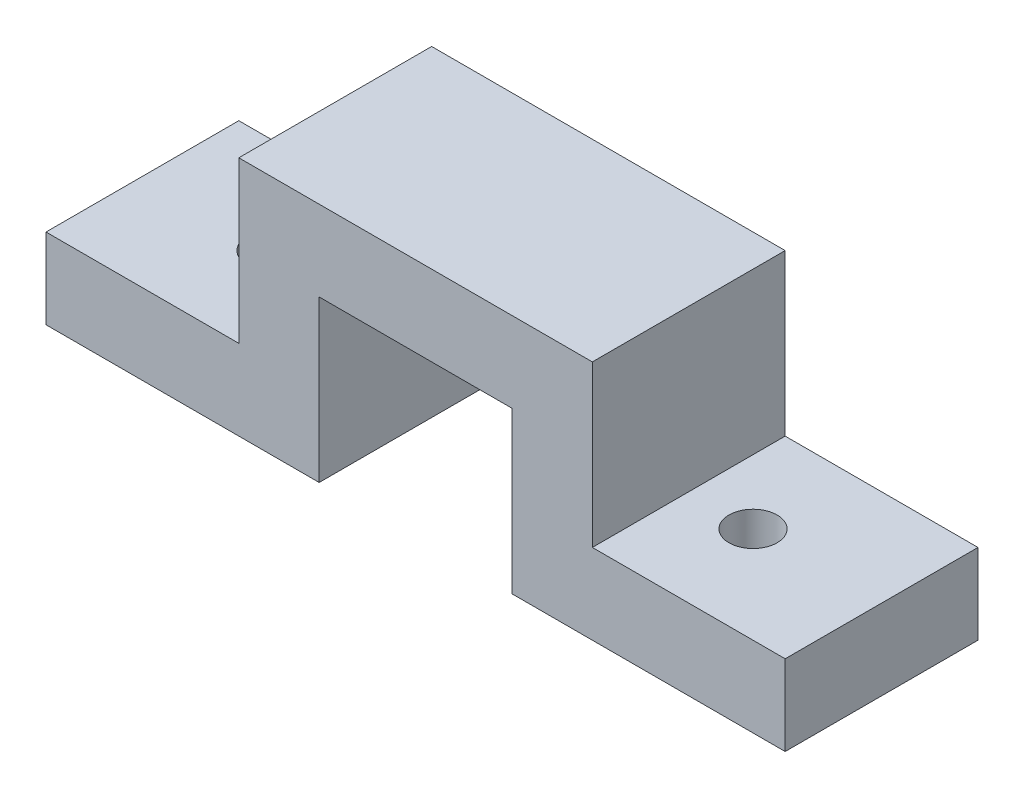
ISO-10303-21;
HEADER;
FILE_DESCRIPTION(('STEP AP214'),'2;1');
FILE_NAME('part.step','',(''),(''),'','','');
FILE_SCHEMA(('AUTOMOTIVE_DESIGN { 1 0 10303 214 1 1 1 1 }'));
ENDSEC;
DATA;
#1=APPLICATION_CONTEXT('core data for automotive mechanical design processes');
#2=APPLICATION_PROTOCOL_DEFINITION('international standard','automotive_design',2000,#1);
#3=PRODUCT_CONTEXT('',#1,'mechanical');
#4=PRODUCT('Part','Part','',(#3));
#5=PRODUCT_RELATED_PRODUCT_CATEGORY('part','',(#4));
#6=PRODUCT_DEFINITION_FORMATION('','',#4);
#7=PRODUCT_DEFINITION_CONTEXT('part definition',#1,'design');
#8=PRODUCT_DEFINITION('design','',#6,#7);
#9=PRODUCT_DEFINITION_SHAPE('','',#8);
#10=(LENGTH_UNIT() NAMED_UNIT(*) SI_UNIT(.MILLI.,.METRE.));
#11=(NAMED_UNIT(*) PLANE_ANGLE_UNIT() SI_UNIT($,.RADIAN.));
#12=(NAMED_UNIT(*) SI_UNIT($,.STERADIAN.) SOLID_ANGLE_UNIT());
#13=UNCERTAINTY_MEASURE_WITH_UNIT(LENGTH_MEASURE(1.E-05),#10,'distance_accuracy_value','');
#14=(GEOMETRIC_REPRESENTATION_CONTEXT(3) GLOBAL_UNCERTAINTY_ASSIGNED_CONTEXT((#13)) GLOBAL_UNIT_ASSIGNED_CONTEXT((#10,
#11,#12)) REPRESENTATION_CONTEXT('',''));
#15=CARTESIAN_POINT('',(0.,0.,0.));
#16=DIRECTION('',(0.,0.,1.));
#17=DIRECTION('',(1.,0.,0.));
#18=AXIS2_PLACEMENT_3D('',#15,#16,#17);
#19=CARTESIAN_POINT('',(11.,15.,12.));
#20=DIRECTION('',(-1.,0.,0.));
#21=DIRECTION('',(0.,-1.,0.));
#22=AXIS2_PLACEMENT_3D('',#19,#20,#21);
#23=PLANE('',#22);
#24=DIRECTION('',(0.,1.,0.));
#25=VECTOR('',#24,1.);
#26=CARTESIAN_POINT('',(11.,15.,0.));
#27=LINE('',#26,#25);
#28=CARTESIAN_POINT('',(11.,5.,0.));
#29=VERTEX_POINT('',#28);
#30=CARTESIAN_POINT('',(11.,15.,0.));
#31=VERTEX_POINT('',#30);
#32=EDGE_CURVE('E155',#29,#31,#27,.T.);
#33=ORIENTED_EDGE('',*,*,#32,.T.);
#34=DIRECTION('',(0.,0.,-1.));
#35=VECTOR('',#34,1.);
#36=CARTESIAN_POINT('',(11.,15.,12.));
#37=LINE('',#36,#35);
#38=CARTESIAN_POINT('',(11.,15.,12.));
#39=VERTEX_POINT('',#38);
#40=EDGE_CURVE('E11',#39,#31,#37,.T.);
#41=ORIENTED_EDGE('',*,*,#40,.F.);
#42=DIRECTION('',(0.,1.,0.));
#43=VECTOR('',#42,1.);
#44=CARTESIAN_POINT('',(11.,15.,12.));
#45=LINE('',#44,#43);
#46=CARTESIAN_POINT('',(11.,5.,12.));
#47=VERTEX_POINT('',#46);
#48=EDGE_CURVE('E178',#47,#39,#45,.T.);
#49=ORIENTED_EDGE('',*,*,#48,.F.);
#50=DIRECTION('',(0.,0.,-1.));
#51=VECTOR('',#50,1.);
#52=CARTESIAN_POINT('',(11.,5.,12.));
#53=LINE('',#52,#51);
#54=EDGE_CURVE('E151',#47,#29,#53,.T.);
#55=ORIENTED_EDGE('',*,*,#54,.T.);
#56=EDGE_LOOP('',(#33,#41,#49,#55));
#57=FACE_BOUND('',#56,.T.);
#58=ADVANCED_FACE('F33',(#57),#23,.F.);
#59=CARTESIAN_POINT('',(-11.,15.,12.));
#60=DIRECTION('',(0.,-1.,0.));
#61=DIRECTION('',(0.,0.,-1.));
#62=AXIS2_PLACEMENT_3D('',#59,#60,#61);
#63=PLANE('',#62);
#64=DIRECTION('',(-1.,0.,0.));
#65=VECTOR('',#64,1.);
#66=CARTESIAN_POINT('',(-11.,15.,0.));
#67=LINE('',#66,#65);
#68=CARTESIAN_POINT('',(-11.,15.,0.));
#69=VERTEX_POINT('',#68);
#70=EDGE_CURVE('E158',#31,#69,#67,.T.);
#71=ORIENTED_EDGE('',*,*,#70,.T.);
#72=DIRECTION('',(0.,0.,-1.));
#73=VECTOR('',#72,1.);
#74=CARTESIAN_POINT('',(-11.,15.,12.));
#75=LINE('',#74,#73);
#76=CARTESIAN_POINT('',(-11.,15.,12.));
#77=VERTEX_POINT('',#76);
#78=EDGE_CURVE('E42',#77,#69,#75,.T.);
#79=ORIENTED_EDGE('',*,*,#78,.F.);
#80=DIRECTION('',(-1.,0.,0.));
#81=VECTOR('',#80,1.);
#82=CARTESIAN_POINT('',(-11.,15.,12.));
#83=LINE('',#82,#81);
#84=EDGE_CURVE('E106',#39,#77,#83,.T.);
#85=ORIENTED_EDGE('',*,*,#84,.F.);
#86=ORIENTED_EDGE('',*,*,#40,.T.);
#87=EDGE_LOOP('',(#71,#79,#85,#86));
#88=FACE_BOUND('',#87,.T.);
#89=ADVANCED_FACE('F256',(#88),#63,.F.);
#90=CARTESIAN_POINT('',(-11.,15.,12.));
#91=DIRECTION('',(1.,0.,0.));
#92=DIRECTION('',(0.,1.,0.));
#93=AXIS2_PLACEMENT_3D('',#90,#91,#92);
#94=PLANE('',#93);
#95=DIRECTION('',(0.,-1.,0.));
#96=VECTOR('',#95,1.);
#97=CARTESIAN_POINT('',(-11.,15.,0.));
#98=LINE('',#97,#96);
#99=CARTESIAN_POINT('',(-11.,5.,0.));
#100=VERTEX_POINT('',#99);
#101=EDGE_CURVE('E161',#69,#100,#98,.T.);
#102=ORIENTED_EDGE('',*,*,#101,.T.);
#103=DIRECTION('',(0.,0.,-1.));
#104=VECTOR('',#103,1.);
#105=CARTESIAN_POINT('',(-11.,5.,12.));
#106=LINE('',#105,#104);
#107=CARTESIAN_POINT('',(-11.,5.,12.));
#108=VERTEX_POINT('',#107);
#109=EDGE_CURVE('E197',#108,#100,#106,.T.);
#110=ORIENTED_EDGE('',*,*,#109,.F.);
#111=DIRECTION('',(0.,-1.,0.));
#112=VECTOR('',#111,1.);
#113=CARTESIAN_POINT('',(-11.,15.,12.));
#114=LINE('',#113,#112);
#115=EDGE_CURVE('E216',#77,#108,#114,.T.);
#116=ORIENTED_EDGE('',*,*,#115,.F.);
#117=ORIENTED_EDGE('',*,*,#78,.T.);
#118=EDGE_LOOP('',(#102,#110,#116,#117));
#119=FACE_BOUND('',#118,.T.);
#120=ADVANCED_FACE('F260',(#119),#94,.F.);
#121=CARTESIAN_POINT('',(-11.,5.,12.));
#122=DIRECTION('',(0.,-1.,0.));
#123=DIRECTION('',(1.,0.,0.));
#124=AXIS2_PLACEMENT_3D('',#121,#122,#123);
#125=PLANE('',#124);
#126=CARTESIAN_POINT('',(-15.,5.,6.00000000000001));
#127=DIRECTION('',(0.,-1.,0.));
#128=DIRECTION('',(1.,0.,0.));
#129=AXIS2_PLACEMENT_3D('',#126,#127,#128);
#130=CIRCLE('',#129,1.5);
#131=CARTESIAN_POINT('',(-13.5,5.,6.00000000000001));
#132=VERTEX_POINT('',#131);
#133=EDGE_CURVE('E159',#132,#132,#130,.F.);
#134=ORIENTED_EDGE('',*,*,#133,.F.);
#135=EDGE_LOOP('',(#134));
#136=FACE_BOUND('',#135,.T.);
#137=DIRECTION('',(-1.,0.,0.));
#138=VECTOR('',#137,1.);
#139=CARTESIAN_POINT('',(-11.,5.,0.));
#140=LINE('',#139,#138);
#141=CARTESIAN_POINT('',(-23.,5.,0.));
#142=VERTEX_POINT('',#141);
#143=EDGE_CURVE('E163',#100,#142,#140,.T.);
#144=ORIENTED_EDGE('',*,*,#143,.T.);
#145=DIRECTION('',(0.,0.,-1.));
#146=VECTOR('',#145,1.);
#147=CARTESIAN_POINT('',(-23.,5.,12.));
#148=LINE('',#147,#146);
#149=CARTESIAN_POINT('',(-23.,5.,12.));
#150=VERTEX_POINT('',#149);
#151=EDGE_CURVE('E194',#150,#142,#148,.T.);
#152=ORIENTED_EDGE('',*,*,#151,.F.);
#153=DIRECTION('',(-1.,0.,0.));
#154=VECTOR('',#153,1.);
#155=CARTESIAN_POINT('',(-11.,5.,12.));
#156=LINE('',#155,#154);
#157=EDGE_CURVE('E218',#108,#150,#156,.T.);
#158=ORIENTED_EDGE('',*,*,#157,.F.);
#159=ORIENTED_EDGE('',*,*,#109,.T.);
#160=EDGE_LOOP('',(#144,#152,#158,#159));
#161=FACE_BOUND('',#160,.T.);
#162=ADVANCED_FACE('F264',(#136,#161),#125,.F.);
#163=CARTESIAN_POINT('',(-23.,5.,12.));
#164=DIRECTION('',(1.,0.,0.));
#165=DIRECTION('',(0.,0.,-1.));
#166=AXIS2_PLACEMENT_3D('',#163,#164,#165);
#167=PLANE('',#166);
#168=DIRECTION('',(0.,-1.,0.));
#169=VECTOR('',#168,1.);
#170=CARTESIAN_POINT('',(-23.,5.,0.));
#171=LINE('',#170,#169);
#172=CARTESIAN_POINT('',(-23.,0.,0.));
#173=VERTEX_POINT('',#172);
#174=EDGE_CURVE('E165',#142,#173,#171,.T.);
#175=ORIENTED_EDGE('',*,*,#174,.T.);
#176=DIRECTION('',(0.,0.,-1.));
#177=VECTOR('',#176,1.);
#178=CARTESIAN_POINT('',(-23.,0.,12.));
#179=LINE('',#178,#177);
#180=CARTESIAN_POINT('',(-23.,0.,12.));
#181=VERTEX_POINT('',#180);
#182=EDGE_CURVE('E191',#181,#173,#179,.T.);
#183=ORIENTED_EDGE('',*,*,#182,.F.);
#184=DIRECTION('',(0.,-1.,0.));
#185=VECTOR('',#184,1.);
#186=CARTESIAN_POINT('',(-23.,5.,12.));
#187=LINE('',#186,#185);
#188=EDGE_CURVE('E220',#150,#181,#187,.T.);
#189=ORIENTED_EDGE('',*,*,#188,.F.);
#190=ORIENTED_EDGE('',*,*,#151,.T.);
#191=EDGE_LOOP('',(#175,#183,#189,#190));
#192=FACE_BOUND('',#191,.T.);
#193=ADVANCED_FACE('F270',(#192),#167,.F.);
#194=CARTESIAN_POINT('',(-23.,0.,12.));
#195=DIRECTION('',(0.,1.,0.));
#196=DIRECTION('',(-1.,0.,0.));
#197=AXIS2_PLACEMENT_3D('',#194,#195,#196);
#198=PLANE('',#197);
#199=CARTESIAN_POINT('',(-15.,0.,6.00000000000001));
#200=DIRECTION('',(0.,1.,0.));
#201=DIRECTION('',(-1.,0.,0.));
#202=AXIS2_PLACEMENT_3D('',#199,#200,#201);
#203=CIRCLE('',#202,1.5);
#204=CARTESIAN_POINT('',(-16.5,0.,6.00000000000001));
#205=VERTEX_POINT('',#204);
#206=EDGE_CURVE('E36',#205,#205,#203,.F.);
#207=ORIENTED_EDGE('',*,*,#206,.F.);
#208=EDGE_LOOP('',(#207));
#209=FACE_BOUND('',#208,.T.);
#210=DIRECTION('',(1.,0.,0.));
#211=VECTOR('',#210,1.);
#212=CARTESIAN_POINT('',(-23.,0.,0.));
#213=LINE('',#212,#211);
#214=CARTESIAN_POINT('',(-6.,0.,0.));
#215=VERTEX_POINT('',#214);
#216=EDGE_CURVE('E167',#173,#215,#213,.T.);
#217=ORIENTED_EDGE('',*,*,#216,.T.);
#218=DIRECTION('',(0.,0.,-1.));
#219=VECTOR('',#218,1.);
#220=CARTESIAN_POINT('',(-6.,0.,12.));
#221=LINE('',#220,#219);
#222=CARTESIAN_POINT('',(-6.,0.,12.));
#223=VERTEX_POINT('',#222);
#224=EDGE_CURVE('E188',#223,#215,#221,.T.);
#225=ORIENTED_EDGE('',*,*,#224,.F.);
#226=DIRECTION('',(1.,0.,0.));
#227=VECTOR('',#226,1.);
#228=CARTESIAN_POINT('',(-23.,0.,12.));
#229=LINE('',#228,#227);
#230=EDGE_CURVE('E222',#181,#223,#229,.T.);
#231=ORIENTED_EDGE('',*,*,#230,.F.);
#232=ORIENTED_EDGE('',*,*,#182,.T.);
#233=EDGE_LOOP('',(#217,#225,#231,#232));
#234=FACE_BOUND('',#233,.T.);
#235=ADVANCED_FACE('F274',(#209,#234),#198,.F.);
#236=CARTESIAN_POINT('',(-6.,0.,12.));
#237=DIRECTION('',(-1.,0.,0.));
#238=DIRECTION('',(0.,-1.,0.));
#239=AXIS2_PLACEMENT_3D('',#236,#237,#238);
#240=PLANE('',#239);
#241=DIRECTION('',(0.,1.,0.));
#242=VECTOR('',#241,1.);
#243=CARTESIAN_POINT('',(-6.,0.,0.));
#244=LINE('',#243,#242);
#245=CARTESIAN_POINT('',(-6.,10.,0.));
#246=VERTEX_POINT('',#245);
#247=EDGE_CURVE('E169',#215,#246,#244,.T.);
#248=ORIENTED_EDGE('',*,*,#247,.T.);
#249=DIRECTION('',(0.,0.,-1.));
#250=VECTOR('',#249,1.);
#251=CARTESIAN_POINT('',(-6.,10.,12.));
#252=LINE('',#251,#250);
#253=CARTESIAN_POINT('',(-6.,10.,12.));
#254=VERTEX_POINT('',#253);
#255=EDGE_CURVE('E185',#254,#246,#252,.T.);
#256=ORIENTED_EDGE('',*,*,#255,.F.);
#257=DIRECTION('',(0.,1.,0.));
#258=VECTOR('',#257,1.);
#259=CARTESIAN_POINT('',(-6.,0.,12.));
#260=LINE('',#259,#258);
#261=EDGE_CURVE('E224',#223,#254,#260,.T.);
#262=ORIENTED_EDGE('',*,*,#261,.F.);
#263=ORIENTED_EDGE('',*,*,#224,.T.);
#264=EDGE_LOOP('',(#248,#256,#262,#263));
#265=FACE_BOUND('',#264,.T.);
#266=ADVANCED_FACE('F278',(#265),#240,.F.);
#267=CARTESIAN_POINT('',(6.,10.,12.));
#268=DIRECTION('',(0.,1.,0.));
#269=DIRECTION('',(0.,0.,1.));
#270=AXIS2_PLACEMENT_3D('',#267,#268,#269);
#271=PLANE('',#270);
#272=DIRECTION('',(1.,0.,0.));
#273=VECTOR('',#272,1.);
#274=CARTESIAN_POINT('',(6.,10.,0.));
#275=LINE('',#274,#273);
#276=CARTESIAN_POINT('',(6.,10.,0.));
#277=VERTEX_POINT('',#276);
#278=EDGE_CURVE('E171',#246,#277,#275,.T.);
#279=ORIENTED_EDGE('',*,*,#278,.T.);
#280=DIRECTION('',(0.,0.,-1.));
#281=VECTOR('',#280,1.);
#282=CARTESIAN_POINT('',(6.,10.,12.));
#283=LINE('',#282,#281);
#284=CARTESIAN_POINT('',(6.,10.,12.));
#285=VERTEX_POINT('',#284);
#286=EDGE_CURVE('E182',#285,#277,#283,.T.);
#287=ORIENTED_EDGE('',*,*,#286,.F.);
#288=DIRECTION('',(1.,0.,0.));
#289=VECTOR('',#288,1.);
#290=CARTESIAN_POINT('',(6.,10.,12.));
#291=LINE('',#290,#289);
#292=EDGE_CURVE('E226',#254,#285,#291,.T.);
#293=ORIENTED_EDGE('',*,*,#292,.F.);
#294=ORIENTED_EDGE('',*,*,#255,.T.);
#295=EDGE_LOOP('',(#279,#287,#293,#294));
#296=FACE_BOUND('',#295,.T.);
#297=ADVANCED_FACE('F232',(#296),#271,.F.);
#298=CARTESIAN_POINT('',(6.,0.,12.));
#299=DIRECTION('',(1.,0.,0.));
#300=DIRECTION('',(0.,1.,0.));
#301=AXIS2_PLACEMENT_3D('',#298,#299,#300);
#302=PLANE('',#301);
#303=DIRECTION('',(0.,-1.,0.));
#304=VECTOR('',#303,1.);
#305=CARTESIAN_POINT('',(6.,0.,0.));
#306=LINE('',#305,#304);
#307=CARTESIAN_POINT('',(6.,0.,0.));
#308=VERTEX_POINT('',#307);
#309=EDGE_CURVE('E173',#277,#308,#306,.T.);
#310=ORIENTED_EDGE('',*,*,#309,.T.);
#311=DIRECTION('',(0.,0.,-1.));
#312=VECTOR('',#311,1.);
#313=CARTESIAN_POINT('',(6.,0.,12.));
#314=LINE('',#313,#312);
#315=CARTESIAN_POINT('',(6.,0.,12.));
#316=VERTEX_POINT('',#315);
#317=EDGE_CURVE('E146',#316,#308,#314,.T.);
#318=ORIENTED_EDGE('',*,*,#317,.F.);
#319=DIRECTION('',(0.,-1.,0.));
#320=VECTOR('',#319,1.);
#321=CARTESIAN_POINT('',(6.,0.,12.));
#322=LINE('',#321,#320);
#323=EDGE_CURVE('E137',#285,#316,#322,.T.);
#324=ORIENTED_EDGE('',*,*,#323,.F.);
#325=ORIENTED_EDGE('',*,*,#286,.T.);
#326=EDGE_LOOP('',(#310,#318,#324,#325));
#327=FACE_BOUND('',#326,.T.);
#328=ADVANCED_FACE('F236',(#327),#302,.F.);
#329=CARTESIAN_POINT('',(23.,0.,12.));
#330=DIRECTION('',(0.,1.,0.));
#331=DIRECTION('',(-1.,0.,0.));
#332=AXIS2_PLACEMENT_3D('',#329,#330,#331);
#333=PLANE('',#332);
#334=CARTESIAN_POINT('',(15.,0.,6.));
#335=DIRECTION('',(0.,1.,0.));
#336=DIRECTION('',(-1.,0.,0.));
#337=AXIS2_PLACEMENT_3D('',#334,#335,#336);
#338=CIRCLE('',#337,1.5);
#339=CARTESIAN_POINT('',(13.5,0.,6.));
#340=VERTEX_POINT('',#339);
#341=EDGE_CURVE('E203',#340,#340,#338,.F.);
#342=ORIENTED_EDGE('',*,*,#341,.F.);
#343=EDGE_LOOP('',(#342));
#344=FACE_BOUND('',#343,.T.);
#345=DIRECTION('',(1.,0.,0.));
#346=VECTOR('',#345,1.);
#347=CARTESIAN_POINT('',(23.,0.,0.));
#348=LINE('',#347,#346);
#349=CARTESIAN_POINT('',(23.,0.,0.));
#350=VERTEX_POINT('',#349);
#351=EDGE_CURVE('E145',#308,#350,#348,.T.);
#352=ORIENTED_EDGE('',*,*,#351,.T.);
#353=DIRECTION('',(0.,0.,-1.));
#354=VECTOR('',#353,1.);
#355=CARTESIAN_POINT('',(23.,0.,12.));
#356=LINE('',#355,#354);
#357=CARTESIAN_POINT('',(23.,0.,12.));
#358=VERTEX_POINT('',#357);
#359=EDGE_CURVE('E142',#358,#350,#356,.T.);
#360=ORIENTED_EDGE('',*,*,#359,.F.);
#361=DIRECTION('',(1.,0.,0.));
#362=VECTOR('',#361,1.);
#363=CARTESIAN_POINT('',(23.,0.,12.));
#364=LINE('',#363,#362);
#365=EDGE_CURVE('E131',#316,#358,#364,.T.);
#366=ORIENTED_EDGE('',*,*,#365,.F.);
#367=ORIENTED_EDGE('',*,*,#317,.T.);
#368=EDGE_LOOP('',(#352,#360,#366,#367));
#369=FACE_BOUND('',#368,.T.);
#370=ADVANCED_FACE('F143',(#344,#369),#333,.F.);
#371=CARTESIAN_POINT('',(23.,5.,12.));
#372=DIRECTION('',(-1.,0.,0.));
#373=DIRECTION('',(0.,0.,1.));
#374=AXIS2_PLACEMENT_3D('',#371,#372,#373);
#375=PLANE('',#374);
#376=DIRECTION('',(0.,1.,0.));
#377=VECTOR('',#376,1.);
#378=CARTESIAN_POINT('',(23.,5.,0.));
#379=LINE('',#378,#377);
#380=CARTESIAN_POINT('',(23.,5.,0.));
#381=VERTEX_POINT('',#380);
#382=EDGE_CURVE('E92',#350,#381,#379,.T.);
#383=ORIENTED_EDGE('',*,*,#382,.T.);
#384=DIRECTION('',(0.,0.,-1.));
#385=VECTOR('',#384,1.);
#386=CARTESIAN_POINT('',(23.,5.,12.));
#387=LINE('',#386,#385);
#388=CARTESIAN_POINT('',(23.,5.,12.));
#389=VERTEX_POINT('',#388);
#390=EDGE_CURVE('E147',#389,#381,#387,.T.);
#391=ORIENTED_EDGE('',*,*,#390,.F.);
#392=DIRECTION('',(0.,1.,0.));
#393=VECTOR('',#392,1.);
#394=CARTESIAN_POINT('',(23.,5.,12.));
#395=LINE('',#394,#393);
#396=EDGE_CURVE('E135',#358,#389,#395,.T.);
#397=ORIENTED_EDGE('',*,*,#396,.F.);
#398=ORIENTED_EDGE('',*,*,#359,.T.);
#399=EDGE_LOOP('',(#383,#391,#397,#398));
#400=FACE_BOUND('',#399,.T.);
#401=ADVANCED_FACE('F149',(#400),#375,.F.);
#402=CARTESIAN_POINT('',(11.,5.,12.));
#403=DIRECTION('',(0.,-1.,0.));
#404=DIRECTION('',(1.,0.,0.));
#405=AXIS2_PLACEMENT_3D('',#402,#403,#404);
#406=PLANE('',#405);
#407=CARTESIAN_POINT('',(15.,5.,6.));
#408=DIRECTION('',(0.,-1.,0.));
#409=DIRECTION('',(1.,0.,0.));
#410=AXIS2_PLACEMENT_3D('',#407,#408,#409);
#411=CIRCLE('',#410,1.5);
#412=CARTESIAN_POINT('',(16.5,5.,6.));
#413=VERTEX_POINT('',#412);
#414=EDGE_CURVE('E201',#413,#413,#411,.F.);
#415=ORIENTED_EDGE('',*,*,#414,.F.);
#416=EDGE_LOOP('',(#415));
#417=FACE_BOUND('',#416,.T.);
#418=DIRECTION('',(-1.,0.,0.));
#419=VECTOR('',#418,1.);
#420=CARTESIAN_POINT('',(11.,5.,0.));
#421=LINE('',#420,#419);
#422=EDGE_CURVE('E98',#381,#29,#421,.T.);
#423=ORIENTED_EDGE('',*,*,#422,.T.);
#424=ORIENTED_EDGE('',*,*,#54,.F.);
#425=DIRECTION('',(-1.,0.,0.));
#426=VECTOR('',#425,1.);
#427=CARTESIAN_POINT('',(11.,5.,12.));
#428=LINE('',#427,#426);
#429=EDGE_CURVE('E51',#389,#47,#428,.T.);
#430=ORIENTED_EDGE('',*,*,#429,.F.);
#431=ORIENTED_EDGE('',*,*,#390,.T.);
#432=EDGE_LOOP('',(#423,#424,#430,#431));
#433=FACE_BOUND('',#432,.T.);
#434=ADVANCED_FACE('F244',(#417,#433),#406,.F.);
#435=CARTESIAN_POINT('',(0.,0.,12.));
#436=DIRECTION('',(0.,0.,1.));
#437=DIRECTION('',(1.,0.,0.));
#438=AXIS2_PLACEMENT_3D('',#435,#436,#437);
#439=PLANE('',#438);
#440=ORIENTED_EDGE('',*,*,#48,.T.);
#441=ORIENTED_EDGE('',*,*,#84,.T.);
#442=ORIENTED_EDGE('',*,*,#115,.T.);
#443=ORIENTED_EDGE('',*,*,#157,.T.);
#444=ORIENTED_EDGE('',*,*,#188,.T.);
#445=ORIENTED_EDGE('',*,*,#230,.T.);
#446=ORIENTED_EDGE('',*,*,#261,.T.);
#447=ORIENTED_EDGE('',*,*,#292,.T.);
#448=ORIENTED_EDGE('',*,*,#323,.T.);
#449=ORIENTED_EDGE('',*,*,#365,.T.);
#450=ORIENTED_EDGE('',*,*,#396,.T.);
#451=ORIENTED_EDGE('',*,*,#429,.T.);
#452=EDGE_LOOP('',(#440,#441,#442,#443,#444,#445,#446,#447,#448,#449,#450,#451));
#453=FACE_BOUND('',#452,.T.);
#454=ADVANCED_FACE('F133',(#453),#439,.T.);
#455=CARTESIAN_POINT('',(0.,0.,0.));
#456=DIRECTION('',(0.,0.,1.));
#457=DIRECTION('',(1.,0.,0.));
#458=AXIS2_PLACEMENT_3D('',#455,#456,#457);
#459=PLANE('',#458);
#460=ORIENTED_EDGE('',*,*,#32,.F.);
#461=ORIENTED_EDGE('',*,*,#422,.F.);
#462=ORIENTED_EDGE('',*,*,#382,.F.);
#463=ORIENTED_EDGE('',*,*,#351,.F.);
#464=ORIENTED_EDGE('',*,*,#309,.F.);
#465=ORIENTED_EDGE('',*,*,#278,.F.);
#466=ORIENTED_EDGE('',*,*,#247,.F.);
#467=ORIENTED_EDGE('',*,*,#216,.F.);
#468=ORIENTED_EDGE('',*,*,#174,.F.);
#469=ORIENTED_EDGE('',*,*,#143,.F.);
#470=ORIENTED_EDGE('',*,*,#101,.F.);
#471=ORIENTED_EDGE('',*,*,#70,.F.);
#472=EDGE_LOOP('',(#460,#461,#462,#463,#464,#465,#466,#467,#468,#469,#470,#471));
#473=FACE_BOUND('',#472,.T.);
#474=ADVANCED_FACE('F239',(#473),#459,.F.);
#475=CARTESIAN_POINT('',(15.,15.,6.));
#476=DIRECTION('',(0.,-1.,0.));
#477=DIRECTION('',(0.,0.,-1.));
#478=AXIS2_PLACEMENT_3D('',#475,#476,#477);
#479=CYLINDRICAL_SURFACE('',#478,1.5);
#480=ORIENTED_EDGE('',*,*,#414,.T.);
#481=EDGE_LOOP('',(#480));
#482=FACE_BOUND('',#481,.T.);
#483=ORIENTED_EDGE('',*,*,#341,.T.);
#484=EDGE_LOOP('',(#483));
#485=FACE_BOUND('',#484,.T.);
#486=ADVANCED_FACE('F317',(#482,#485),#479,.F.);
#487=CARTESIAN_POINT('',(-15.,15.,6.00000000000001));
#488=DIRECTION('',(0.,-1.,0.));
#489=DIRECTION('',(0.,0.,-1.));
#490=AXIS2_PLACEMENT_3D('',#487,#488,#489);
#491=CYLINDRICAL_SURFACE('',#490,1.5);
#492=ORIENTED_EDGE('',*,*,#206,.T.);
#493=EDGE_LOOP('',(#492));
#494=FACE_BOUND('',#493,.T.);
#495=ORIENTED_EDGE('',*,*,#133,.T.);
#496=EDGE_LOOP('',(#495));
#497=FACE_BOUND('',#496,.T.);
#498=ADVANCED_FACE('F371',(#494,#497),#491,.F.);
#499=CLOSED_SHELL('',(#58,#89,#120,#162,#193,#235,#266,#297,#328,#370,#401,#434,#454,#474,#486,#498));
#500=MANIFOLD_SOLID_BREP('B2',#499);
#501=ADVANCED_BREP_SHAPE_REPRESENTATION('',(#18,#500),#14);
#502=SHAPE_DEFINITION_REPRESENTATION(#9,#501);
ENDSEC;
END-ISO-10303-21;
